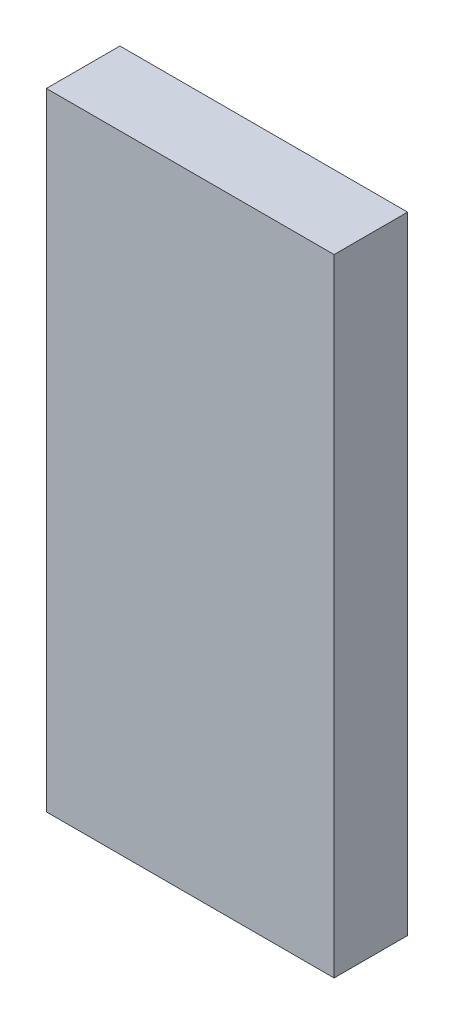
ISO-10303-21;
HEADER;
FILE_DESCRIPTION(('STEP AP214'),'2;1');
FILE_NAME('part.step','',(''),(''),'','','');
FILE_SCHEMA(('AUTOMOTIVE_DESIGN { 1 0 10303 214 1 1 1 1 }'));
ENDSEC;
DATA;
#1=APPLICATION_CONTEXT('core data for automotive mechanical design processes');
#2=APPLICATION_PROTOCOL_DEFINITION('international standard','automotive_design',2000,#1);
#3=PRODUCT_CONTEXT('',#1,'mechanical');
#4=PRODUCT('Part','Part','',(#3));
#5=PRODUCT_RELATED_PRODUCT_CATEGORY('part','',(#4));
#6=PRODUCT_DEFINITION_FORMATION('','',#4);
#7=PRODUCT_DEFINITION_CONTEXT('part definition',#1,'design');
#8=PRODUCT_DEFINITION('design','',#6,#7);
#9=PRODUCT_DEFINITION_SHAPE('','',#8);
#10=(LENGTH_UNIT() NAMED_UNIT(*) SI_UNIT(.MILLI.,.METRE.));
#11=(NAMED_UNIT(*) PLANE_ANGLE_UNIT() SI_UNIT($,.RADIAN.));
#12=(NAMED_UNIT(*) SI_UNIT($,.STERADIAN.) SOLID_ANGLE_UNIT());
#13=UNCERTAINTY_MEASURE_WITH_UNIT(LENGTH_MEASURE(1.E-05),#10,'distance_accuracy_value','');
#14=(GEOMETRIC_REPRESENTATION_CONTEXT(3) GLOBAL_UNCERTAINTY_ASSIGNED_CONTEXT((#13)) GLOBAL_UNIT_ASSIGNED_CONTEXT((#10,
#11,#12)) REPRESENTATION_CONTEXT('',''));
#15=CARTESIAN_POINT('',(0.,0.,0.));
#16=DIRECTION('',(0.,0.,1.));
#17=DIRECTION('',(1.,0.,0.));
#18=AXIS2_PLACEMENT_3D('',#15,#16,#17);
#19=CARTESIAN_POINT('',(-2.25000058,4.90000036,1.15000024));
#20=DIRECTION('',(0.,0.,-1.));
#21=DIRECTION('',(-1.,0.,0.));
#22=AXIS2_PLACEMENT_3D('',#19,#20,#21);
#23=PLANE('',#22);
#24=DIRECTION('',(1.,0.,0.));
#25=VECTOR('',#24,1.);
#26=CARTESIAN_POINT('',(-2.25000058,-4.90000036,1.15000024));
#27=LINE('',#26,#25);
#28=CARTESIAN_POINT('',(-2.25000058,-4.90000036,1.15000024));
#29=VERTEX_POINT('',#28);
#30=CARTESIAN_POINT('',(2.24999931,-4.90000036,1.15000024));
#31=VERTEX_POINT('',#30);
#32=EDGE_CURVE('E55',#29,#31,#27,.T.);
#33=ORIENTED_EDGE('',*,*,#32,.T.);
#34=DIRECTION('',(-2.59183589844991E-07,-0.999999999999966,0.));
#35=VECTOR('',#34,1.);
#36=CARTESIAN_POINT('',(2.24999804,-4.90000036,1.15000024));
#37=LINE('',#36,#35);
#38=CARTESIAN_POINT('',(2.25000058000001,4.90000163,1.15000024));
#39=VERTEX_POINT('',#38);
#40=EDGE_CURVE('E57',#31,#39,#37,.F.);
#41=ORIENTED_EDGE('',*,*,#40,.T.);
#42=DIRECTION('',(0.999999999999841,5.6444429827581E-07,0.));
#43=VECTOR('',#42,1.);
#44=CARTESIAN_POINT('',(2.25000058,4.9000029,1.15000024));
#45=LINE('',#44,#43);
#46=CARTESIAN_POINT('',(-2.25000058,4.90000036,1.15000024));
#47=VERTEX_POINT('',#46);
#48=EDGE_CURVE('E20',#39,#47,#45,.F.);
#49=ORIENTED_EDGE('',*,*,#48,.T.);
#50=DIRECTION('',(0.,1.,0.));
#51=VECTOR('',#50,1.);
#52=CARTESIAN_POINT('',(-2.25000058,4.90000036,1.15000024));
#53=LINE('',#52,#51);
#54=EDGE_CURVE('E80',#47,#29,#53,.F.);
#55=ORIENTED_EDGE('',*,*,#54,.T.);
#56=EDGE_LOOP('',(#33,#41,#49,#55));
#57=FACE_BOUND('',#56,.T.);
#58=ADVANCED_FACE('F17',(#57),#23,.F.);
#59=CARTESIAN_POINT('',(2.25000058,4.9000029,0.));
#60=DIRECTION('',(5.6444429827581E-07,-0.999999999999841,0.));
#61=DIRECTION('',(0.999999999999841,5.6444429827581E-07,0.));
#62=AXIS2_PLACEMENT_3D('',#59,#60,#61);
#63=PLANE('',#62);
#64=DIRECTION('',(0.,0.,-1.));
#65=VECTOR('',#64,1.);
#66=CARTESIAN_POINT('',(-2.25000058,4.90000036,0.));
#67=LINE('',#66,#65);
#68=CARTESIAN_POINT('',(-2.25000058,4.90000036,0.));
#69=VERTEX_POINT('',#68);
#70=EDGE_CURVE('E68',#69,#47,#67,.F.);
#71=ORIENTED_EDGE('',*,*,#70,.T.);
#72=ORIENTED_EDGE('',*,*,#48,.F.);
#73=DIRECTION('',(0.,0.,1.));
#74=VECTOR('',#73,1.);
#75=CARTESIAN_POINT('',(2.25000058000003,4.9000029,0.));
#76=LINE('',#75,#74);
#77=CARTESIAN_POINT('',(2.25000058000001,4.900002265,0.));
#78=VERTEX_POINT('',#77);
#79=EDGE_CURVE('E63',#39,#78,#76,.F.);
#80=ORIENTED_EDGE('',*,*,#79,.T.);
#81=DIRECTION('',(-1.,0.,0.));
#82=VECTOR('',#81,1.);
#83=CARTESIAN_POINT('',(-2.25000058,4.90000036,0.));
#84=LINE('',#83,#82);
#85=EDGE_CURVE('E83',#69,#78,#84,.F.);
#86=ORIENTED_EDGE('',*,*,#85,.F.);
#87=EDGE_LOOP('',(#71,#72,#80,#86));
#88=FACE_BOUND('',#87,.T.);
#89=ADVANCED_FACE('F65',(#88),#63,.F.);
#90=CARTESIAN_POINT('',(2.24999804,-4.90000036,0.));
#91=DIRECTION('',(-0.999999999999966,2.59183589844991E-07,0.));
#92=DIRECTION('',(-2.59183589844991E-07,-0.999999999999966,0.));
#93=AXIS2_PLACEMENT_3D('',#90,#91,#92);
#94=PLANE('',#93);
#95=ORIENTED_EDGE('',*,*,#79,.F.);
#96=ORIENTED_EDGE('',*,*,#40,.F.);
#97=DIRECTION('',(0.,0.,1.));
#98=VECTOR('',#97,1.);
#99=CARTESIAN_POINT('',(2.24999804,-4.90000036,0.));
#100=LINE('',#99,#98);
#101=CARTESIAN_POINT('',(2.249998675,-4.90000036,0.));
#102=VERTEX_POINT('',#101);
#103=EDGE_CURVE('E75',#31,#102,#100,.F.);
#104=ORIENTED_EDGE('',*,*,#103,.T.);
#105=DIRECTION('',(0.,1.,0.));
#106=VECTOR('',#105,1.);
#107=CARTESIAN_POINT('',(2.25000058,4.90000036,0.));
#108=LINE('',#107,#106);
#109=EDGE_CURVE('E72',#78,#102,#108,.F.);
#110=ORIENTED_EDGE('',*,*,#109,.F.);
#111=EDGE_LOOP('',(#95,#96,#104,#110));
#112=FACE_BOUND('',#111,.T.);
#113=ADVANCED_FACE('F70',(#112),#94,.F.);
#114=CARTESIAN_POINT('',(-2.25000058,-4.90000036,0.));
#115=DIRECTION('',(0.,1.,0.));
#116=DIRECTION('',(0.,0.,1.));
#117=AXIS2_PLACEMENT_3D('',#114,#115,#116);
#118=PLANE('',#117);
#119=ORIENTED_EDGE('',*,*,#103,.F.);
#120=ORIENTED_EDGE('',*,*,#32,.F.);
#121=DIRECTION('',(0.,0.,-1.));
#122=VECTOR('',#121,1.);
#123=CARTESIAN_POINT('',(-2.25000058,-4.90000036,0.));
#124=LINE('',#123,#122);
#125=CARTESIAN_POINT('',(-2.25000058,-4.90000036,0.));
#126=VERTEX_POINT('',#125);
#127=EDGE_CURVE('E35',#29,#126,#124,.T.);
#128=ORIENTED_EDGE('',*,*,#127,.T.);
#129=DIRECTION('',(-1.,0.,0.));
#130=VECTOR('',#129,1.);
#131=CARTESIAN_POINT('',(-2.25000058,-4.90000036,0.));
#132=LINE('',#131,#130);
#133=EDGE_CURVE('E26',#102,#126,#132,.T.);
#134=ORIENTED_EDGE('',*,*,#133,.F.);
#135=EDGE_LOOP('',(#119,#120,#128,#134));
#136=FACE_BOUND('',#135,.T.);
#137=ADVANCED_FACE('F89',(#136),#118,.F.);
#138=CARTESIAN_POINT('',(-2.25000058,4.90000036,0.));
#139=DIRECTION('',(1.,0.,0.));
#140=DIRECTION('',(0.,0.,-1.));
#141=AXIS2_PLACEMENT_3D('',#138,#139,#140);
#142=PLANE('',#141);
#143=ORIENTED_EDGE('',*,*,#127,.F.);
#144=ORIENTED_EDGE('',*,*,#54,.F.);
#145=ORIENTED_EDGE('',*,*,#70,.F.);
#146=DIRECTION('',(0.,1.,0.));
#147=VECTOR('',#146,1.);
#148=CARTESIAN_POINT('',(-2.25000058,4.90000036,0.));
#149=LINE('',#148,#147);
#150=EDGE_CURVE('E11',#126,#69,#149,.T.);
#151=ORIENTED_EDGE('',*,*,#150,.F.);
#152=EDGE_LOOP('',(#143,#144,#145,#151));
#153=FACE_BOUND('',#152,.T.);
#154=ADVANCED_FACE('F91',(#153),#142,.F.);
#155=CARTESIAN_POINT('',(-2.25000058,4.90000036,0.));
#156=DIRECTION('',(0.,0.,-1.));
#157=DIRECTION('',(-1.,0.,0.));
#158=AXIS2_PLACEMENT_3D('',#155,#156,#157);
#159=PLANE('',#158);
#160=ORIENTED_EDGE('',*,*,#133,.T.);
#161=ORIENTED_EDGE('',*,*,#150,.T.);
#162=ORIENTED_EDGE('',*,*,#85,.T.);
#163=ORIENTED_EDGE('',*,*,#109,.T.);
#164=EDGE_LOOP('',(#160,#161,#162,#163));
#165=FACE_BOUND('',#164,.T.);
#166=ADVANCED_FACE('F88',(#165),#159,.T.);
#167=CLOSED_SHELL('',(#58,#89,#113,#137,#154,#166));
#168=MANIFOLD_SOLID_BREP('B1',#167);
#169=ADVANCED_BREP_SHAPE_REPRESENTATION('',(#18,#168),#14);
#170=SHAPE_DEFINITION_REPRESENTATION(#9,#169);
ENDSEC;
END-ISO-10303-21;
